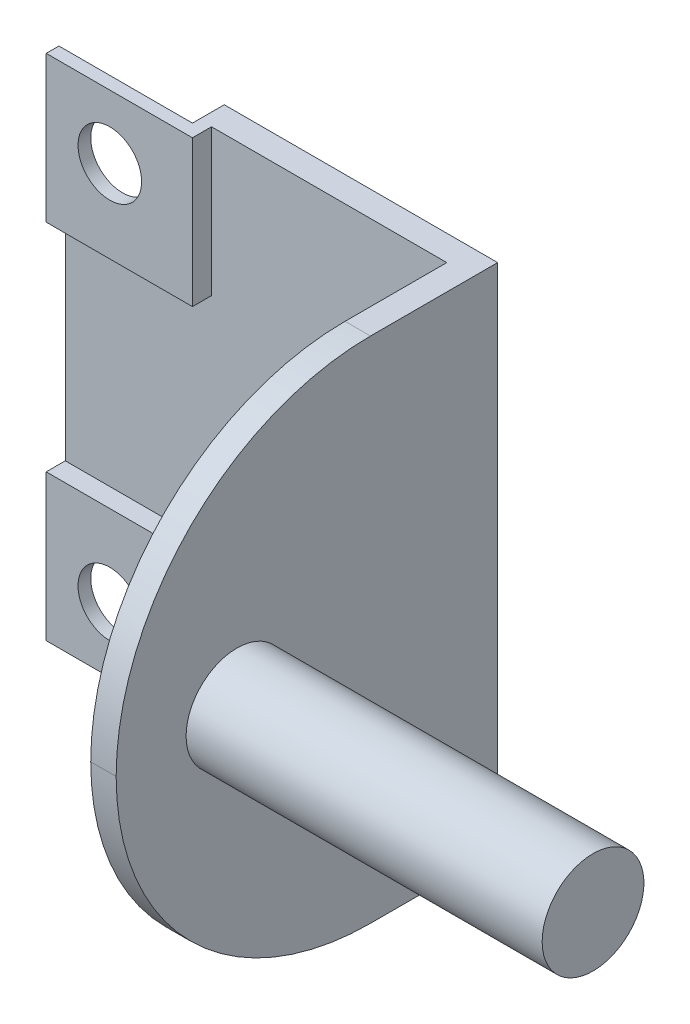
ISO-10303-21;
HEADER;
FILE_DESCRIPTION(('STEP AP214'),'2;1');
FILE_NAME('part.step','',(''),(''),'','','');
FILE_SCHEMA(('AUTOMOTIVE_DESIGN { 1 0 10303 214 1 1 1 1 }'));
ENDSEC;
DATA;
#1=APPLICATION_CONTEXT('core data for automotive mechanical design processes');
#2=APPLICATION_PROTOCOL_DEFINITION('international standard','automotive_design',2000,#1);
#3=PRODUCT_CONTEXT('',#1,'mechanical');
#4=PRODUCT('Part','Part','',(#3));
#5=PRODUCT_RELATED_PRODUCT_CATEGORY('part','',(#4));
#6=PRODUCT_DEFINITION_FORMATION('','',#4);
#7=PRODUCT_DEFINITION_CONTEXT('part definition',#1,'design');
#8=PRODUCT_DEFINITION('design','',#6,#7);
#9=PRODUCT_DEFINITION_SHAPE('','',#8);
#10=(LENGTH_UNIT() NAMED_UNIT(*) SI_UNIT(.MILLI.,.METRE.));
#11=(NAMED_UNIT(*) PLANE_ANGLE_UNIT() SI_UNIT($,.RADIAN.));
#12=(NAMED_UNIT(*) SI_UNIT($,.STERADIAN.) SOLID_ANGLE_UNIT());
#13=UNCERTAINTY_MEASURE_WITH_UNIT(LENGTH_MEASURE(1.E-05),#10,'distance_accuracy_value','');
#14=(GEOMETRIC_REPRESENTATION_CONTEXT(3) GLOBAL_UNCERTAINTY_ASSIGNED_CONTEXT((#13)) GLOBAL_UNIT_ASSIGNED_CONTEXT((#10,
#11,#12)) REPRESENTATION_CONTEXT('',''));
#15=CARTESIAN_POINT('',(0.,0.,0.));
#16=DIRECTION('',(0.,0.,1.));
#17=DIRECTION('',(1.,0.,0.));
#18=AXIS2_PLACEMENT_3D('',#15,#16,#17);
#19=CARTESIAN_POINT('',(-32.,10.5,-28.));
#20=DIRECTION('',(0.,1.,0.));
#21=DIRECTION('',(-1.,0.,0.));
#22=AXIS2_PLACEMENT_3D('',#19,#20,#21);
#23=PLANE('',#22);
#24=DIRECTION('',(1.,0.,0.));
#25=VECTOR('',#24,1.);
#26=CARTESIAN_POINT('',(-32.,10.5,2.5));
#27=LINE('',#26,#25);
#28=CARTESIAN_POINT('',(-32.,10.5,2.5));
#29=VERTEX_POINT('',#28);
#30=CARTESIAN_POINT('',(-21.5,10.5,2.5));
#31=VERTEX_POINT('',#30);
#32=EDGE_CURVE('E179',#29,#31,#27,.T.);
#33=ORIENTED_EDGE('',*,*,#32,.F.);
#34=DIRECTION('',(0.,0.,1.));
#35=VECTOR('',#34,1.);
#36=CARTESIAN_POINT('',(-32.,10.5,-28.));
#37=LINE('',#36,#35);
#38=CARTESIAN_POINT('',(-32.,10.5,0.));
#39=VERTEX_POINT('',#38);
#40=EDGE_CURVE('E191',#39,#29,#37,.T.);
#41=ORIENTED_EDGE('',*,*,#40,.F.);
#42=DIRECTION('',(-1.,0.,0.));
#43=VECTOR('',#42,1.);
#44=CARTESIAN_POINT('',(0.,10.5,0.));
#45=LINE('',#44,#43);
#46=CARTESIAN_POINT('',(-21.5,10.5,0.));
#47=VERTEX_POINT('',#46);
#48=EDGE_CURVE('E291',#47,#39,#45,.T.);
#49=ORIENTED_EDGE('',*,*,#48,.F.);
#50=DIRECTION('',(0.,0.,1.));
#51=VECTOR('',#50,1.);
#52=CARTESIAN_POINT('',(-21.5,10.5,-28.));
#53=LINE('',#52,#51);
#54=EDGE_CURVE('E67',#47,#31,#53,.T.);
#55=ORIENTED_EDGE('',*,*,#54,.T.);
#56=EDGE_LOOP('',(#33,#41,#49,#55));
#57=FACE_BOUND('',#56,.T.);
#58=ADVANCED_FACE('F41',(#57),#23,.F.);
#59=CARTESIAN_POINT('',(-21.5,0.,-28.));
#60=DIRECTION('',(1.,0.,0.));
#61=DIRECTION('',(0.,1.,0.));
#62=AXIS2_PLACEMENT_3D('',#59,#60,#61);
#63=PLANE('',#62);
#64=DIRECTION('',(0.,-1.,0.));
#65=VECTOR('',#64,1.);
#66=CARTESIAN_POINT('',(-21.5,0.,2.50000000000001));
#67=LINE('',#66,#65);
#68=CARTESIAN_POINT('',(-21.5,0.,2.50000000000001));
#69=VERTEX_POINT('',#68);
#70=EDGE_CURVE('E188',#31,#69,#67,.T.);
#71=ORIENTED_EDGE('',*,*,#70,.F.);
#72=ORIENTED_EDGE('',*,*,#54,.F.);
#73=DIRECTION('',(0.,1.,0.));
#74=VECTOR('',#73,1.);
#75=CARTESIAN_POINT('',(-21.5,0.,0.));
#76=LINE('',#75,#74);
#77=CARTESIAN_POINT('',(-21.5,0.,0.));
#78=VERTEX_POINT('',#77);
#79=EDGE_CURVE('E284',#78,#47,#76,.T.);
#80=ORIENTED_EDGE('',*,*,#79,.F.);
#81=DIRECTION('',(0.,0.,1.));
#82=VECTOR('',#81,1.);
#83=CARTESIAN_POINT('',(-21.5,0.,-28.));
#84=LINE('',#83,#82);
#85=EDGE_CURVE('E209',#78,#69,#84,.T.);
#86=ORIENTED_EDGE('',*,*,#85,.T.);
#87=EDGE_LOOP('',(#71,#72,#80,#86));
#88=FACE_BOUND('',#87,.T.);
#89=ADVANCED_FACE('F476',(#88),#63,.F.);
#90=CARTESIAN_POINT('',(-21.5,40.,-28.));
#91=DIRECTION('',(1.,0.,0.));
#92=DIRECTION('',(0.,0.,-1.));
#93=AXIS2_PLACEMENT_3D('',#90,#91,#92);
#94=PLANE('',#93);
#95=DIRECTION('',(0.,-1.,0.));
#96=VECTOR('',#95,1.);
#97=CARTESIAN_POINT('',(-21.5,40.,2.5));
#98=LINE('',#97,#96);
#99=CARTESIAN_POINT('',(-21.5,40.,2.5));
#100=VERTEX_POINT('',#99);
#101=CARTESIAN_POINT('',(-21.5,29.5,2.5));
#102=VERTEX_POINT('',#101);
#103=EDGE_CURVE('E194',#100,#102,#98,.T.);
#104=ORIENTED_EDGE('',*,*,#103,.F.);
#105=DIRECTION('',(0.,0.,1.));
#106=VECTOR('',#105,1.);
#107=CARTESIAN_POINT('',(-21.5,40.,-28.));
#108=LINE('',#107,#106);
#109=CARTESIAN_POINT('',(-21.5,40.,0.));
#110=VERTEX_POINT('',#109);
#111=EDGE_CURVE('E222',#110,#100,#108,.T.);
#112=ORIENTED_EDGE('',*,*,#111,.F.);
#113=DIRECTION('',(0.,1.,0.));
#114=VECTOR('',#113,1.);
#115=CARTESIAN_POINT('',(-21.5,0.,0.));
#116=LINE('',#115,#114);
#117=CARTESIAN_POINT('',(-21.5,29.5,0.));
#118=VERTEX_POINT('',#117);
#119=EDGE_CURVE('E11',#118,#110,#116,.T.);
#120=ORIENTED_EDGE('',*,*,#119,.F.);
#121=DIRECTION('',(0.,0.,1.));
#122=VECTOR('',#121,1.);
#123=CARTESIAN_POINT('',(-21.5,29.5,-28.));
#124=LINE('',#123,#122);
#125=EDGE_CURVE('E59',#118,#102,#124,.T.);
#126=ORIENTED_EDGE('',*,*,#125,.T.);
#127=EDGE_LOOP('',(#104,#112,#120,#126));
#128=FACE_BOUND('',#127,.T.);
#129=ADVANCED_FACE('F401',(#128),#94,.F.);
#130=CARTESIAN_POINT('',(-32.,29.5,-28.));
#131=DIRECTION('',(0.,-1.,0.));
#132=DIRECTION('',(0.,0.,-1.));
#133=AXIS2_PLACEMENT_3D('',#130,#131,#132);
#134=PLANE('',#133);
#135=DIRECTION('',(1.,0.,0.));
#136=VECTOR('',#135,1.);
#137=CARTESIAN_POINT('',(-32.,29.5,2.5));
#138=LINE('',#137,#136);
#139=CARTESIAN_POINT('',(-32.,29.5,2.5));
#140=VERTEX_POINT('',#139);
#141=EDGE_CURVE('E328',#140,#102,#138,.T.);
#142=ORIENTED_EDGE('',*,*,#141,.T.);
#143=ORIENTED_EDGE('',*,*,#125,.F.);
#144=DIRECTION('',(1.,0.,0.));
#145=VECTOR('',#144,1.);
#146=CARTESIAN_POINT('',(0.,29.5,0.));
#147=LINE('',#146,#145);
#148=CARTESIAN_POINT('',(-32.,29.5,0.));
#149=VERTEX_POINT('',#148);
#150=EDGE_CURVE('E51',#149,#118,#147,.T.);
#151=ORIENTED_EDGE('',*,*,#150,.F.);
#152=DIRECTION('',(0.,0.,1.));
#153=VECTOR('',#152,1.);
#154=CARTESIAN_POINT('',(-32.,29.5,-28.));
#155=LINE('',#154,#153);
#156=EDGE_CURVE('E203',#149,#140,#155,.T.);
#157=ORIENTED_EDGE('',*,*,#156,.T.);
#158=EDGE_LOOP('',(#142,#143,#151,#157));
#159=FACE_BOUND('',#158,.T.);
#160=ADVANCED_FACE('F405',(#159),#134,.F.);
#161=CARTESIAN_POINT('',(0.,0.,2.));
#162=DIRECTION('',(-1.,0.,0.));
#163=DIRECTION('',(0.,-1.,0.));
#164=AXIS2_PLACEMENT_3D('',#161,#162,#163);
#165=PLANE('',#164);
#166=CARTESIAN_POINT('',(0.,20.,20.5));
#167=DIRECTION('',(1.,0.,0.));
#168=DIRECTION('',(0.,1.,0.));
#169=AXIS2_PLACEMENT_3D('',#166,#167,#168);
#170=CIRCLE('',#169,4.);
#171=CARTESIAN_POINT('',(0.,24.,20.5));
#172=VERTEX_POINT('',#171);
#173=EDGE_CURVE('E217',#172,#172,#170,.T.);
#174=ORIENTED_EDGE('',*,*,#173,.F.);
#175=EDGE_LOOP('',(#174));
#176=FACE_BOUND('',#175,.T.);
#177=DIRECTION('',(0.,0.,-1.));
#178=VECTOR('',#177,1.);
#179=CARTESIAN_POINT('',(0.,40.,2.));
#180=LINE('',#179,#178);
#181=CARTESIAN_POINT('',(0.,40.,10.));
#182=VERTEX_POINT('',#181);
#183=CARTESIAN_POINT('',(0.,40.,0.));
#184=VERTEX_POINT('',#183);
#185=EDGE_CURVE('E262',#182,#184,#180,.T.);
#186=ORIENTED_EDGE('',*,*,#185,.F.);
#187=CARTESIAN_POINT('',(0.,20.,10.));
#188=DIRECTION('',(-1.,0.,0.));
#189=DIRECTION('',(0.,-1.,0.));
#190=AXIS2_PLACEMENT_3D('',#187,#188,#189);
#191=CIRCLE('',#190,20.);
#192=CARTESIAN_POINT('',(0.,20.,30.));
#193=VERTEX_POINT('',#192);
#194=EDGE_CURVE('E278',#182,#193,#191,.F.);
#195=ORIENTED_EDGE('',*,*,#194,.T.);
#196=CARTESIAN_POINT('',(0.,20.,10.));
#197=DIRECTION('',(-1.,0.,0.));
#198=DIRECTION('',(0.,-1.,0.));
#199=AXIS2_PLACEMENT_3D('',#196,#197,#198);
#200=CIRCLE('',#199,20.);
#201=CARTESIAN_POINT('',(0.,0.,10.));
#202=VERTEX_POINT('',#201);
#203=EDGE_CURVE('E275',#193,#202,#200,.F.);
#204=ORIENTED_EDGE('',*,*,#203,.T.);
#205=DIRECTION('',(0.,0.,-1.));
#206=VECTOR('',#205,1.);
#207=CARTESIAN_POINT('',(0.,0.,2.));
#208=LINE('',#207,#206);
#209=CARTESIAN_POINT('',(0.,0.,0.));
#210=VERTEX_POINT('',#209);
#211=EDGE_CURVE('E247',#202,#210,#208,.T.);
#212=ORIENTED_EDGE('',*,*,#211,.T.);
#213=DIRECTION('',(0.,1.,0.));
#214=VECTOR('',#213,1.);
#215=CARTESIAN_POINT('',(0.,0.,0.));
#216=LINE('',#215,#214);
#217=EDGE_CURVE('E234',#210,#184,#216,.T.);
#218=ORIENTED_EDGE('',*,*,#217,.T.);
#219=EDGE_LOOP('',(#186,#195,#204,#212,#218));
#220=FACE_BOUND('',#219,.T.);
#221=ADVANCED_FACE('F419',(#176,#220),#165,.F.);
#222=CARTESIAN_POINT('',(0.,40.,2.));
#223=DIRECTION('',(0.,-1.,0.));
#224=DIRECTION('',(1.,0.,0.));
#225=AXIS2_PLACEMENT_3D('',#222,#223,#224);
#226=PLANE('',#225);
#227=DIRECTION('',(-1.,0.,0.));
#228=VECTOR('',#227,1.);
#229=CARTESIAN_POINT('',(0.,40.,0.));
#230=LINE('',#229,#228);
#231=EDGE_CURVE('E251',#184,#110,#230,.T.);
#232=ORIENTED_EDGE('',*,*,#231,.T.);
#233=ORIENTED_EDGE('',*,*,#111,.T.);
#234=DIRECTION('',(1.,0.,0.));
#235=VECTOR('',#234,1.);
#236=CARTESIAN_POINT('',(-32.,40.,2.5));
#237=LINE('',#236,#235);
#238=CARTESIAN_POINT('',(-32.,40.,2.5));
#239=VERTEX_POINT('',#238);
#240=EDGE_CURVE('E333',#239,#100,#237,.T.);
#241=ORIENTED_EDGE('',*,*,#240,.F.);
#242=DIRECTION('',(0.,0.,-1.));
#243=VECTOR('',#242,1.);
#244=CARTESIAN_POINT('',(-32.,40.,3.5));
#245=LINE('',#244,#243);
#246=CARTESIAN_POINT('',(-32.,40.,3.5));
#247=VERTEX_POINT('',#246);
#248=EDGE_CURVE('E322',#247,#239,#245,.T.);
#249=ORIENTED_EDGE('',*,*,#248,.F.);
#250=DIRECTION('',(-1.,0.,0.));
#251=VECTOR('',#250,1.);
#252=CARTESIAN_POINT('',(0.,40.,3.5));
#253=LINE('',#252,#251);
#254=CARTESIAN_POINT('',(-20.5,40.,3.5));
#255=VERTEX_POINT('',#254);
#256=EDGE_CURVE('E371',#255,#247,#253,.T.);
#257=ORIENTED_EDGE('',*,*,#256,.F.);
#258=DIRECTION('',(0.,0.,-1.));
#259=VECTOR('',#258,1.);
#260=CARTESIAN_POINT('',(-20.5,40.,3.5));
#261=LINE('',#260,#259);
#262=CARTESIAN_POINT('',(-20.5,40.,2.));
#263=VERTEX_POINT('',#262);
#264=EDGE_CURVE('E216',#255,#263,#261,.T.);
#265=ORIENTED_EDGE('',*,*,#264,.T.);
#266=DIRECTION('',(-1.,0.,0.));
#267=VECTOR('',#266,1.);
#268=CARTESIAN_POINT('',(0.,40.,2.));
#269=LINE('',#268,#267);
#270=CARTESIAN_POINT('',(-2.,40.,2.));
#271=VERTEX_POINT('',#270);
#272=EDGE_CURVE('E235',#271,#263,#269,.T.);
#273=ORIENTED_EDGE('',*,*,#272,.F.);
#274=DIRECTION('',(0.,0.,-1.));
#275=VECTOR('',#274,1.);
#276=CARTESIAN_POINT('',(-2.,40.,30.));
#277=LINE('',#276,#275);
#278=CARTESIAN_POINT('',(-2.,40.,10.));
#279=VERTEX_POINT('',#278);
#280=EDGE_CURVE('E231',#279,#271,#277,.T.);
#281=ORIENTED_EDGE('',*,*,#280,.F.);
#282=DIRECTION('',(-1.,0.,0.));
#283=VECTOR('',#282,1.);
#284=CARTESIAN_POINT('',(0.,40.,10.));
#285=LINE('',#284,#283);
#286=EDGE_CURVE('E271',#279,#182,#285,.F.);
#287=ORIENTED_EDGE('',*,*,#286,.T.);
#288=ORIENTED_EDGE('',*,*,#185,.T.);
#289=EDGE_LOOP('',(#232,#233,#241,#249,#257,#265,#273,#281,#287,#288));
#290=FACE_BOUND('',#289,.T.);
#291=ADVANCED_FACE('F413',(#290),#226,.F.);
#292=CARTESIAN_POINT('',(-32.,0.,2.));
#293=DIRECTION('',(1.,0.,0.));
#294=DIRECTION('',(0.,0.,-1.));
#295=AXIS2_PLACEMENT_3D('',#292,#293,#294);
#296=PLANE('',#295);
#297=DIRECTION('',(0.,-1.,0.));
#298=VECTOR('',#297,1.);
#299=CARTESIAN_POINT('',(-32.,0.,2.));
#300=LINE('',#299,#298);
#301=CARTESIAN_POINT('',(-32.,28.5,2.));
#302=VERTEX_POINT('',#301);
#303=CARTESIAN_POINT('',(-32.,11.5,2.));
#304=VERTEX_POINT('',#303);
#305=EDGE_CURVE('E239',#302,#304,#300,.T.);
#306=ORIENTED_EDGE('',*,*,#305,.F.);
#307=DIRECTION('',(0.,0.,-1.));
#308=VECTOR('',#307,1.);
#309=CARTESIAN_POINT('',(-32.,28.5,3.5));
#310=LINE('',#309,#308);
#311=CARTESIAN_POINT('',(-32.,28.5,3.5));
#312=VERTEX_POINT('',#311);
#313=EDGE_CURVE('E391',#312,#302,#310,.T.);
#314=ORIENTED_EDGE('',*,*,#313,.F.);
#315=DIRECTION('',(0.,-1.,0.));
#316=VECTOR('',#315,1.);
#317=CARTESIAN_POINT('',(-32.,0.,3.5));
#318=LINE('',#317,#316);
#319=EDGE_CURVE('E376',#247,#312,#318,.T.);
#320=ORIENTED_EDGE('',*,*,#319,.F.);
#321=ORIENTED_EDGE('',*,*,#248,.T.);
#322=DIRECTION('',(0.,-1.,0.));
#323=VECTOR('',#322,1.);
#324=CARTESIAN_POINT('',(-32.,40.,2.5));
#325=LINE('',#324,#323);
#326=EDGE_CURVE('E325',#239,#140,#325,.T.);
#327=ORIENTED_EDGE('',*,*,#326,.T.);
#328=ORIENTED_EDGE('',*,*,#156,.F.);
#329=DIRECTION('',(0.,-1.,0.));
#330=VECTOR('',#329,1.);
#331=CARTESIAN_POINT('',(-32.,0.,0.));
#332=LINE('',#331,#330);
#333=EDGE_CURVE('E201',#149,#39,#332,.T.);
#334=ORIENTED_EDGE('',*,*,#333,.T.);
#335=ORIENTED_EDGE('',*,*,#40,.T.);
#336=DIRECTION('',(0.,-1.,0.));
#337=VECTOR('',#336,1.);
#338=CARTESIAN_POINT('',(-32.,0.,2.50000000000001));
#339=LINE('',#338,#337);
#340=CARTESIAN_POINT('',(-32.,0.,2.50000000000001));
#341=VERTEX_POINT('',#340);
#342=EDGE_CURVE('E176',#29,#341,#339,.T.);
#343=ORIENTED_EDGE('',*,*,#342,.T.);
#344=DIRECTION('',(0.,0.,1.));
#345=VECTOR('',#344,1.);
#346=CARTESIAN_POINT('',(-32.,0.,3.50000000000001));
#347=LINE('',#346,#345);
#348=CARTESIAN_POINT('',(-32.,0.,3.50000000000001));
#349=VERTEX_POINT('',#348);
#350=EDGE_CURVE('E187',#341,#349,#347,.T.);
#351=ORIENTED_EDGE('',*,*,#350,.T.);
#352=DIRECTION('',(0.,-1.,0.));
#353=VECTOR('',#352,1.);
#354=CARTESIAN_POINT('',(-32.,0.,3.5));
#355=LINE('',#354,#353);
#356=CARTESIAN_POINT('',(-32.,11.5,3.5));
#357=VERTEX_POINT('',#356);
#358=EDGE_CURVE('E341',#357,#349,#355,.T.);
#359=ORIENTED_EDGE('',*,*,#358,.F.);
#360=DIRECTION('',(0.,0.,-1.));
#361=VECTOR('',#360,1.);
#362=CARTESIAN_POINT('',(-32.,11.5,3.5));
#363=LINE('',#362,#361);
#364=EDGE_CURVE('E363',#357,#304,#363,.T.);
#365=ORIENTED_EDGE('',*,*,#364,.T.);
#366=EDGE_LOOP('',(#306,#314,#320,#321,#327,#328,#334,#335,#343,#351,#359,#365));
#367=FACE_BOUND('',#366,.T.);
#368=ADVANCED_FACE('F198',(#367),#296,.F.);
#369=CARTESIAN_POINT('',(0.,0.,2.));
#370=DIRECTION('',(0.,1.,0.));
#371=DIRECTION('',(-1.,0.,0.));
#372=AXIS2_PLACEMENT_3D('',#369,#370,#371);
#373=PLANE('',#372);
#374=DIRECTION('',(1.,0.,0.));
#375=VECTOR('',#374,1.);
#376=CARTESIAN_POINT('',(0.,0.,2.));
#377=LINE('',#376,#375);
#378=CARTESIAN_POINT('',(-20.5,0.,2.));
#379=VERTEX_POINT('',#378);
#380=CARTESIAN_POINT('',(-2.,0.,2.));
#381=VERTEX_POINT('',#380);
#382=EDGE_CURVE('E244',#379,#381,#377,.T.);
#383=ORIENTED_EDGE('',*,*,#382,.F.);
#384=DIRECTION('',(0.,0.,-1.));
#385=VECTOR('',#384,1.);
#386=CARTESIAN_POINT('',(-20.5,0.,3.5));
#387=LINE('',#386,#385);
#388=CARTESIAN_POINT('',(-20.5,0.,3.5));
#389=VERTEX_POINT('',#388);
#390=EDGE_CURVE('E360',#389,#379,#387,.T.);
#391=ORIENTED_EDGE('',*,*,#390,.F.);
#392=DIRECTION('',(1.,0.,0.));
#393=VECTOR('',#392,1.);
#394=CARTESIAN_POINT('',(0.,0.,3.5));
#395=LINE('',#394,#393);
#396=EDGE_CURVE('E345',#349,#389,#395,.T.);
#397=ORIENTED_EDGE('',*,*,#396,.F.);
#398=ORIENTED_EDGE('',*,*,#350,.F.);
#399=DIRECTION('',(1.,0.,0.));
#400=VECTOR('',#399,1.);
#401=CARTESIAN_POINT('',(-32.,0.,2.50000000000001));
#402=LINE('',#401,#400);
#403=EDGE_CURVE('E181',#341,#69,#402,.T.);
#404=ORIENTED_EDGE('',*,*,#403,.T.);
#405=ORIENTED_EDGE('',*,*,#85,.F.);
#406=DIRECTION('',(1.,0.,0.));
#407=VECTOR('',#406,1.);
#408=CARTESIAN_POINT('',(0.,0.,0.));
#409=LINE('',#408,#407);
#410=EDGE_CURVE('E240',#78,#210,#409,.T.);
#411=ORIENTED_EDGE('',*,*,#410,.T.);
#412=ORIENTED_EDGE('',*,*,#211,.F.);
#413=DIRECTION('',(1.,0.,0.));
#414=VECTOR('',#413,1.);
#415=CARTESIAN_POINT('',(-2.,0.,10.));
#416=LINE('',#415,#414);
#417=CARTESIAN_POINT('',(-2.,0.,10.));
#418=VERTEX_POINT('',#417);
#419=EDGE_CURVE('E281',#202,#418,#416,.F.);
#420=ORIENTED_EDGE('',*,*,#419,.T.);
#421=DIRECTION('',(0.,0.,-1.));
#422=VECTOR('',#421,1.);
#423=CARTESIAN_POINT('',(-2.,0.,30.));
#424=LINE('',#423,#422);
#425=EDGE_CURVE('E227',#418,#381,#424,.T.);
#426=ORIENTED_EDGE('',*,*,#425,.T.);
#427=EDGE_LOOP('',(#383,#391,#397,#398,#404,#405,#411,#412,#420,#426));
#428=FACE_BOUND('',#427,.T.);
#429=ADVANCED_FACE('F425',(#428),#373,.F.);
#430=CARTESIAN_POINT('',(0.,0.,2.));
#431=DIRECTION('',(0.,0.,1.));
#432=DIRECTION('',(1.,0.,0.));
#433=AXIS2_PLACEMENT_3D('',#430,#431,#432);
#434=PLANE('',#433);
#435=DIRECTION('',(1.,0.,0.));
#436=VECTOR('',#435,1.);
#437=CARTESIAN_POINT('',(0.,11.5,2.));
#438=LINE('',#437,#436);
#439=CARTESIAN_POINT('',(-20.5,11.5,2.));
#440=VERTEX_POINT('',#439);
#441=EDGE_CURVE('E336',#304,#440,#438,.T.);
#442=ORIENTED_EDGE('',*,*,#441,.T.);
#443=DIRECTION('',(0.,1.,0.));
#444=VECTOR('',#443,1.);
#445=CARTESIAN_POINT('',(-20.5,0.,2.));
#446=LINE('',#445,#444);
#447=EDGE_CURVE('E342',#379,#440,#446,.T.);
#448=ORIENTED_EDGE('',*,*,#447,.F.);
#449=ORIENTED_EDGE('',*,*,#382,.T.);
#450=DIRECTION('',(0.,-1.,0.));
#451=VECTOR('',#450,1.);
#452=CARTESIAN_POINT('',(-2.,0.,2.));
#453=LINE('',#452,#451);
#454=EDGE_CURVE('E223',#271,#381,#453,.T.);
#455=ORIENTED_EDGE('',*,*,#454,.F.);
#456=ORIENTED_EDGE('',*,*,#272,.T.);
#457=DIRECTION('',(0.,-1.,0.));
#458=VECTOR('',#457,1.);
#459=CARTESIAN_POINT('',(-20.5,0.,2.));
#460=LINE('',#459,#458);
#461=CARTESIAN_POINT('',(-20.5,28.5,2.));
#462=VERTEX_POINT('',#461);
#463=EDGE_CURVE('E366',#263,#462,#460,.T.);
#464=ORIENTED_EDGE('',*,*,#463,.T.);
#465=DIRECTION('',(1.,0.,0.));
#466=VECTOR('',#465,1.);
#467=CARTESIAN_POINT('',(0.,28.5,2.));
#468=LINE('',#467,#466);
#469=EDGE_CURVE('E372',#302,#462,#468,.T.);
#470=ORIENTED_EDGE('',*,*,#469,.F.);
#471=ORIENTED_EDGE('',*,*,#305,.T.);
#472=EDGE_LOOP('',(#442,#448,#449,#455,#456,#464,#470,#471));
#473=FACE_BOUND('',#472,.T.);
#474=ADVANCED_FACE('F441',(#473),#434,.T.);
#475=CARTESIAN_POINT('',(0.,0.,0.));
#476=DIRECTION('',(0.,0.,1.));
#477=DIRECTION('',(1.,0.,0.));
#478=AXIS2_PLACEMENT_3D('',#475,#476,#477);
#479=PLANE('',#478);
#480=ORIENTED_EDGE('',*,*,#150,.T.);
#481=ORIENTED_EDGE('',*,*,#119,.T.);
#482=ORIENTED_EDGE('',*,*,#231,.F.);
#483=ORIENTED_EDGE('',*,*,#217,.F.);
#484=ORIENTED_EDGE('',*,*,#410,.F.);
#485=ORIENTED_EDGE('',*,*,#79,.T.);
#486=ORIENTED_EDGE('',*,*,#48,.T.);
#487=ORIENTED_EDGE('',*,*,#333,.F.);
#488=EDGE_LOOP('',(#480,#481,#482,#483,#484,#485,#486,#487));
#489=FACE_BOUND('',#488,.T.);
#490=ADVANCED_FACE('F404',(#489),#479,.F.);
#491=CARTESIAN_POINT('',(-2.,0.,30.));
#492=DIRECTION('',(1.,0.,0.));
#493=DIRECTION('',(0.,0.,-1.));
#494=AXIS2_PLACEMENT_3D('',#491,#492,#493);
#495=PLANE('',#494);
#496=CARTESIAN_POINT('',(-2.,20.,10.));
#497=DIRECTION('',(1.,0.,0.));
#498=DIRECTION('',(0.,0.,-1.));
#499=AXIS2_PLACEMENT_3D('',#496,#497,#498);
#500=CIRCLE('',#499,20.);
#501=CARTESIAN_POINT('',(-2.,20.,30.));
#502=VERTEX_POINT('',#501);
#503=EDGE_CURVE('E265',#418,#502,#500,.F.);
#504=ORIENTED_EDGE('',*,*,#503,.T.);
#505=CARTESIAN_POINT('',(-2.,20.,10.));
#506=DIRECTION('',(1.,0.,0.));
#507=DIRECTION('',(0.,0.,-1.));
#508=AXIS2_PLACEMENT_3D('',#505,#506,#507);
#509=CIRCLE('',#508,20.);
#510=EDGE_CURVE('E268',#502,#279,#509,.F.);
#511=ORIENTED_EDGE('',*,*,#510,.T.);
#512=ORIENTED_EDGE('',*,*,#280,.T.);
#513=ORIENTED_EDGE('',*,*,#454,.T.);
#514=ORIENTED_EDGE('',*,*,#425,.F.);
#515=EDGE_LOOP('',(#504,#511,#512,#513,#514));
#516=FACE_BOUND('',#515,.T.);
#517=ADVANCED_FACE('F433',(#516),#495,.F.);
#518=CARTESIAN_POINT('',(0.,20.,10.));
#519=DIRECTION('',(-1.,0.,0.));
#520=DIRECTION('',(0.,-1.,0.));
#521=AXIS2_PLACEMENT_3D('',#518,#519,#520);
#522=CYLINDRICAL_SURFACE('',#521,20.);
#523=ORIENTED_EDGE('',*,*,#419,.F.);
#524=ORIENTED_EDGE('',*,*,#203,.F.);
#525=DIRECTION('',(1.,0.,0.));
#526=VECTOR('',#525,1.);
#527=CARTESIAN_POINT('',(0.,20.,30.));
#528=LINE('',#527,#526);
#529=EDGE_CURVE('E221',#502,#193,#528,.T.);
#530=ORIENTED_EDGE('',*,*,#529,.F.);
#531=ORIENTED_EDGE('',*,*,#503,.F.);
#532=EDGE_LOOP('',(#523,#524,#530,#531));
#533=FACE_BOUND('',#532,.T.);
#534=ADVANCED_FACE('F43',(#533),#522,.T.);
#535=CARTESIAN_POINT('',(0.,20.,10.));
#536=DIRECTION('',(1.,0.,0.));
#537=DIRECTION('',(0.,1.,0.));
#538=AXIS2_PLACEMENT_3D('',#535,#536,#537);
#539=CYLINDRICAL_SURFACE('',#538,20.);
#540=ORIENTED_EDGE('',*,*,#194,.F.);
#541=ORIENTED_EDGE('',*,*,#286,.F.);
#542=ORIENTED_EDGE('',*,*,#510,.F.);
#543=ORIENTED_EDGE('',*,*,#529,.T.);
#544=EDGE_LOOP('',(#540,#541,#542,#543));
#545=FACE_BOUND('',#544,.T.);
#546=ADVANCED_FACE('F466',(#545),#539,.T.);
#547=CARTESIAN_POINT('',(-20.5,0.,3.5));
#548=DIRECTION('',(1.,0.,0.));
#549=DIRECTION('',(0.,0.,-1.));
#550=AXIS2_PLACEMENT_3D('',#547,#548,#549);
#551=PLANE('',#550);
#552=ORIENTED_EDGE('',*,*,#463,.F.);
#553=ORIENTED_EDGE('',*,*,#264,.F.);
#554=DIRECTION('',(0.,-1.,0.));
#555=VECTOR('',#554,1.);
#556=CARTESIAN_POINT('',(-20.5,0.,3.5));
#557=LINE('',#556,#555);
#558=CARTESIAN_POINT('',(-20.5,28.5,3.5));
#559=VERTEX_POINT('',#558);
#560=EDGE_CURVE('E367',#255,#559,#557,.T.);
#561=ORIENTED_EDGE('',*,*,#560,.T.);
#562=DIRECTION('',(0.,0.,-1.));
#563=VECTOR('',#562,1.);
#564=CARTESIAN_POINT('',(-20.5,28.5,3.5));
#565=LINE('',#564,#563);
#566=EDGE_CURVE('E382',#559,#462,#565,.T.);
#567=ORIENTED_EDGE('',*,*,#566,.T.);
#568=EDGE_LOOP('',(#552,#553,#561,#567));
#569=FACE_BOUND('',#568,.T.);
#570=ADVANCED_FACE('F464',(#569),#551,.T.);
#571=CARTESIAN_POINT('',(0.,28.5,3.5));
#572=DIRECTION('',(0.,1.,0.));
#573=DIRECTION('',(0.,0.,1.));
#574=AXIS2_PLACEMENT_3D('',#571,#572,#573);
#575=PLANE('',#574);
#576=ORIENTED_EDGE('',*,*,#469,.T.);
#577=ORIENTED_EDGE('',*,*,#566,.F.);
#578=DIRECTION('',(1.,0.,0.));
#579=VECTOR('',#578,1.);
#580=CARTESIAN_POINT('',(0.,28.5,3.5));
#581=LINE('',#580,#579);
#582=EDGE_CURVE('E379',#312,#559,#581,.T.);
#583=ORIENTED_EDGE('',*,*,#582,.F.);
#584=ORIENTED_EDGE('',*,*,#313,.T.);
#585=EDGE_LOOP('',(#576,#577,#583,#584));
#586=FACE_BOUND('',#585,.T.);
#587=ADVANCED_FACE('F458',(#586),#575,.F.);
#588=CARTESIAN_POINT('',(0.,0.,3.5));
#589=DIRECTION('',(0.,0.,1.));
#590=DIRECTION('',(1.,0.,0.));
#591=AXIS2_PLACEMENT_3D('',#588,#589,#590);
#592=PLANE('',#591);
#593=CARTESIAN_POINT('',(-27.,35.,3.5));
#594=DIRECTION('',(0.,0.,1.));
#595=DIRECTION('',(1.,0.,0.));
#596=AXIS2_PLACEMENT_3D('',#593,#594,#595);
#597=CIRCLE('',#596,2.5);
#598=CARTESIAN_POINT('',(-24.5,35.,3.5));
#599=VERTEX_POINT('',#598);
#600=EDGE_CURVE('E299',#599,#599,#597,.T.);
#601=ORIENTED_EDGE('',*,*,#600,.F.);
#602=EDGE_LOOP('',(#601));
#603=FACE_BOUND('',#602,.T.);
#604=ORIENTED_EDGE('',*,*,#256,.T.);
#605=ORIENTED_EDGE('',*,*,#319,.T.);
#606=ORIENTED_EDGE('',*,*,#582,.T.);
#607=ORIENTED_EDGE('',*,*,#560,.F.);
#608=EDGE_LOOP('',(#604,#605,#606,#607));
#609=FACE_BOUND('',#608,.T.);
#610=ADVANCED_FACE('F462',(#603,#609),#592,.T.);
#611=CARTESIAN_POINT('',(0.,11.5,3.5));
#612=DIRECTION('',(0.,1.,0.));
#613=DIRECTION('',(0.,0.,1.));
#614=AXIS2_PLACEMENT_3D('',#611,#612,#613);
#615=PLANE('',#614);
#616=ORIENTED_EDGE('',*,*,#441,.F.);
#617=ORIENTED_EDGE('',*,*,#364,.F.);
#618=DIRECTION('',(1.,0.,0.));
#619=VECTOR('',#618,1.);
#620=CARTESIAN_POINT('',(0.,11.5,3.5));
#621=LINE('',#620,#619);
#622=CARTESIAN_POINT('',(-20.5,11.5,3.5));
#623=VERTEX_POINT('',#622);
#624=EDGE_CURVE('E337',#357,#623,#621,.T.);
#625=ORIENTED_EDGE('',*,*,#624,.T.);
#626=DIRECTION('',(0.,0.,-1.));
#627=VECTOR('',#626,1.);
#628=CARTESIAN_POINT('',(-20.5,11.5,3.5));
#629=LINE('',#628,#627);
#630=EDGE_CURVE('E351',#623,#440,#629,.T.);
#631=ORIENTED_EDGE('',*,*,#630,.T.);
#632=EDGE_LOOP('',(#616,#617,#625,#631));
#633=FACE_BOUND('',#632,.T.);
#634=ADVANCED_FACE('F453',(#633),#615,.T.);
#635=CARTESIAN_POINT('',(-20.5,0.,3.5));
#636=DIRECTION('',(-1.,0.,0.));
#637=DIRECTION('',(0.,-1.,0.));
#638=AXIS2_PLACEMENT_3D('',#635,#636,#637);
#639=PLANE('',#638);
#640=ORIENTED_EDGE('',*,*,#447,.T.);
#641=ORIENTED_EDGE('',*,*,#630,.F.);
#642=DIRECTION('',(0.,1.,0.));
#643=VECTOR('',#642,1.);
#644=CARTESIAN_POINT('',(-20.5,0.,3.5));
#645=LINE('',#644,#643);
#646=EDGE_CURVE('E348',#389,#623,#645,.T.);
#647=ORIENTED_EDGE('',*,*,#646,.F.);
#648=ORIENTED_EDGE('',*,*,#390,.T.);
#649=EDGE_LOOP('',(#640,#641,#647,#648));
#650=FACE_BOUND('',#649,.T.);
#651=ADVANCED_FACE('F446',(#650),#639,.F.);
#652=CARTESIAN_POINT('',(0.,0.,3.5));
#653=DIRECTION('',(0.,0.,1.));
#654=DIRECTION('',(1.,0.,0.));
#655=AXIS2_PLACEMENT_3D('',#652,#653,#654);
#656=PLANE('',#655);
#657=CARTESIAN_POINT('',(-27.,4.99999999999999,3.5));
#658=DIRECTION('',(0.,0.,1.));
#659=DIRECTION('',(-1.,0.,0.));
#660=AXIS2_PLACEMENT_3D('',#657,#658,#659);
#661=CIRCLE('',#660,2.5);
#662=CARTESIAN_POINT('',(-24.5,4.99999999999999,3.5));
#663=VERTEX_POINT('',#662);
#664=EDGE_CURVE('E306',#663,#663,#661,.T.);
#665=ORIENTED_EDGE('',*,*,#664,.F.);
#666=EDGE_LOOP('',(#665));
#667=FACE_BOUND('',#666,.T.);
#668=ORIENTED_EDGE('',*,*,#624,.F.);
#669=ORIENTED_EDGE('',*,*,#358,.T.);
#670=ORIENTED_EDGE('',*,*,#396,.T.);
#671=ORIENTED_EDGE('',*,*,#646,.T.);
#672=EDGE_LOOP('',(#668,#669,#670,#671));
#673=FACE_BOUND('',#672,.T.);
#674=ADVANCED_FACE('F449',(#667,#673),#656,.T.);
#675=CARTESIAN_POINT('',(-32.,40.,2.5));
#676=DIRECTION('',(0.,0.,1.));
#677=DIRECTION('',(0.,-1.,0.));
#678=AXIS2_PLACEMENT_3D('',#675,#676,#677);
#679=PLANE('',#678);
#680=CARTESIAN_POINT('',(-27.,35.,2.5));
#681=DIRECTION('',(0.,0.,1.));
#682=DIRECTION('',(0.,-1.,0.));
#683=AXIS2_PLACEMENT_3D('',#680,#681,#682);
#684=CIRCLE('',#683,2.5);
#685=CARTESIAN_POINT('',(-24.5,35.,2.5));
#686=VERTEX_POINT('',#685);
#687=EDGE_CURVE('E45',#686,#686,#684,.T.);
#688=ORIENTED_EDGE('',*,*,#687,.T.);
#689=EDGE_LOOP('',(#688));
#690=FACE_BOUND('',#689,.T.);
#691=ORIENTED_EDGE('',*,*,#103,.T.);
#692=ORIENTED_EDGE('',*,*,#141,.F.);
#693=ORIENTED_EDGE('',*,*,#326,.F.);
#694=ORIENTED_EDGE('',*,*,#240,.T.);
#695=EDGE_LOOP('',(#691,#692,#693,#694));
#696=FACE_BOUND('',#695,.T.);
#697=ADVANCED_FACE('F411',(#690,#696),#679,.F.);
#698=CARTESIAN_POINT('',(-32.,0.,2.50000000000001));
#699=DIRECTION('',(0.,0.,1.));
#700=DIRECTION('',(0.,-1.,0.));
#701=AXIS2_PLACEMENT_3D('',#698,#699,#700);
#702=PLANE('',#701);
#703=CARTESIAN_POINT('',(-27.,4.99999999999999,2.5));
#704=DIRECTION('',(0.,0.,1.));
#705=DIRECTION('',(0.,-1.,0.));
#706=AXIS2_PLACEMENT_3D('',#703,#704,#705);
#707=CIRCLE('',#706,2.5);
#708=CARTESIAN_POINT('',(-24.5,4.99999999999999,2.5));
#709=VERTEX_POINT('',#708);
#710=EDGE_CURVE('E296',#709,#709,#707,.T.);
#711=ORIENTED_EDGE('',*,*,#710,.T.);
#712=EDGE_LOOP('',(#711));
#713=FACE_BOUND('',#712,.T.);
#714=ORIENTED_EDGE('',*,*,#70,.T.);
#715=ORIENTED_EDGE('',*,*,#403,.F.);
#716=ORIENTED_EDGE('',*,*,#342,.F.);
#717=ORIENTED_EDGE('',*,*,#32,.T.);
#718=EDGE_LOOP('',(#714,#715,#716,#717));
#719=FACE_BOUND('',#718,.T.);
#720=ADVANCED_FACE('F178',(#713,#719),#702,.F.);
#721=CARTESIAN_POINT('',(-27.,4.99999999999999,-7.));
#722=DIRECTION('',(0.,0.,1.));
#723=DIRECTION('',(1.,0.,0.));
#724=AXIS2_PLACEMENT_3D('',#721,#722,#723);
#725=CYLINDRICAL_SURFACE('',#724,2.5);
#726=CARTESIAN_POINT('',(-24.5,4.99999999999999,3.5));
#727=CARTESIAN_POINT('',(-24.5,4.99999999999999,3.48958333333333));
#728=CARTESIAN_POINT('',(-24.5,4.99999999999999,3.47916666666667));
#729=CARTESIAN_POINT('',(-24.5,4.99999999999999,3.45833333333333));
#730=CARTESIAN_POINT('',(-24.5,4.99999999999999,3.44791666666667));
#731=CARTESIAN_POINT('',(-24.5,4.99999999999999,3.42708333333333));
#732=CARTESIAN_POINT('',(-24.5,4.99999999999999,3.41666666666667));
#733=CARTESIAN_POINT('',(-24.5,4.99999999999999,3.39583333333333));
#734=CARTESIAN_POINT('',(-24.5,4.99999999999999,3.38541666666667));
#735=CARTESIAN_POINT('',(-24.5,4.99999999999999,3.36458333333333));
#736=CARTESIAN_POINT('',(-24.5,4.99999999999999,3.35416666666667));
#737=CARTESIAN_POINT('',(-24.5,4.99999999999999,3.33333333333333));
#738=CARTESIAN_POINT('',(-24.5,4.99999999999999,3.32291666666667));
#739=CARTESIAN_POINT('',(-24.5,4.99999999999999,3.30208333333333));
#740=CARTESIAN_POINT('',(-24.5,4.99999999999999,3.29166666666667));
#741=CARTESIAN_POINT('',(-24.5,4.99999999999999,3.27083333333333));
#742=CARTESIAN_POINT('',(-24.5,4.99999999999999,3.26041666666667));
#743=CARTESIAN_POINT('',(-24.5,4.99999999999999,3.23958333333333));
#744=CARTESIAN_POINT('',(-24.5,4.99999999999999,3.22916666666667));
#745=CARTESIAN_POINT('',(-24.5,4.99999999999999,3.20833333333333));
#746=CARTESIAN_POINT('',(-24.5,4.99999999999999,3.19791666666667));
#747=CARTESIAN_POINT('',(-24.5,4.99999999999999,3.17708333333333));
#748=CARTESIAN_POINT('',(-24.5,4.99999999999999,3.16666666666667));
#749=CARTESIAN_POINT('',(-24.5,4.99999999999999,3.14583333333333));
#750=CARTESIAN_POINT('',(-24.5,4.99999999999999,3.13541666666667));
#751=CARTESIAN_POINT('',(-24.5,4.99999999999999,3.11458333333333));
#752=CARTESIAN_POINT('',(-24.5,4.99999999999999,3.10416666666667));
#753=CARTESIAN_POINT('',(-24.5,4.99999999999999,3.08333333333333));
#754=CARTESIAN_POINT('',(-24.5,4.99999999999999,3.07291666666667));
#755=CARTESIAN_POINT('',(-24.5,4.99999999999999,3.05208333333333));
#756=CARTESIAN_POINT('',(-24.5,4.99999999999999,3.04166666666667));
#757=CARTESIAN_POINT('',(-24.5,4.99999999999999,3.02083333333333));
#758=CARTESIAN_POINT('',(-24.5,4.99999999999999,3.01041666666667));
#759=CARTESIAN_POINT('',(-24.5,4.99999999999999,2.98958333333333));
#760=CARTESIAN_POINT('',(-24.5,4.99999999999999,2.97916666666667));
#761=CARTESIAN_POINT('',(-24.5,4.99999999999999,2.95833333333333));
#762=CARTESIAN_POINT('',(-24.5,4.99999999999999,2.94791666666667));
#763=CARTESIAN_POINT('',(-24.5,4.99999999999999,2.92708333333333));
#764=CARTESIAN_POINT('',(-24.5,4.99999999999999,2.91666666666667));
#765=CARTESIAN_POINT('',(-24.5,4.99999999999999,2.89583333333333));
#766=CARTESIAN_POINT('',(-24.5,4.99999999999999,2.88541666666667));
#767=CARTESIAN_POINT('',(-24.5,4.99999999999999,2.86458333333333));
#768=CARTESIAN_POINT('',(-24.5,4.99999999999999,2.85416666666667));
#769=CARTESIAN_POINT('',(-24.5,4.99999999999999,2.83333333333333));
#770=CARTESIAN_POINT('',(-24.5,4.99999999999999,2.82291666666667));
#771=CARTESIAN_POINT('',(-24.5,4.99999999999999,2.80208333333333));
#772=CARTESIAN_POINT('',(-24.5,4.99999999999999,2.79166666666667));
#773=CARTESIAN_POINT('',(-24.5,4.99999999999999,2.77083333333333));
#774=CARTESIAN_POINT('',(-24.5,4.99999999999999,2.76041666666667));
#775=CARTESIAN_POINT('',(-24.5,4.99999999999999,2.73958333333334));
#776=CARTESIAN_POINT('',(-24.5,4.99999999999999,2.72916666666667));
#777=CARTESIAN_POINT('',(-24.5,4.99999999999999,2.70833333333334));
#778=CARTESIAN_POINT('',(-24.5,4.99999999999999,2.69791666666667));
#779=CARTESIAN_POINT('',(-24.5,4.99999999999999,2.67708333333334));
#780=CARTESIAN_POINT('',(-24.5,4.99999999999999,2.66666666666667));
#781=CARTESIAN_POINT('',(-24.5,4.99999999999999,2.64583333333334));
#782=CARTESIAN_POINT('',(-24.5,4.99999999999999,2.63541666666667));
#783=CARTESIAN_POINT('',(-24.5,4.99999999999999,2.61458333333334));
#784=CARTESIAN_POINT('',(-24.5,4.99999999999999,2.60416666666667));
#785=CARTESIAN_POINT('',(-24.5,4.99999999999999,2.58333333333334));
#786=CARTESIAN_POINT('',(-24.5,4.99999999999999,2.57291666666667));
#787=CARTESIAN_POINT('',(-24.5,4.99999999999999,2.55208333333334));
#788=CARTESIAN_POINT('',(-24.5,4.99999999999999,2.54166666666667));
#789=CARTESIAN_POINT('',(-24.5,4.99999999999999,2.52083333333334));
#790=CARTESIAN_POINT('',(-24.5,4.99999999999999,2.51041666666667));
#791=CARTESIAN_POINT('',(-24.5,4.99999999999999,2.5));
#792=B_SPLINE_CURVE_WITH_KNOTS('',3,(#726,#727,#728,#729,#730,#731,#732,#733,#734,#735,#736,
#737,#738,#739,#740,#741,#742,#743,#744,#745,#746,#747,#748,#749,#750,#751,#752,#753,#754,#755,
#756,#757,#758,#759,#760,#761,#762,#763,#764,#765,#766,#767,#768,#769,#770,#771,#772,#773,#774,
#775,#776,#777,#778,#779,#780,#781,#782,#783,#784,#785,#786,#787,#788,#789,#790,#791),
.UNSPECIFIED.,.F.,.F.,(4,2,2,2,2,2,2,2,2,2,2,2,2,2,2,2,2,2,2,2,2,2,2,2,2,2,2,2,2,2,2,2,4),(0.,
0.03125,0.0625000000000001,0.0937500000000001,0.125,0.15625,0.1875,0.21875,0.25,
0.281249999999999,0.312499999999999,0.343749999999999,0.374999999999999,0.406249999999999,
0.437499999999999,0.468749999999999,0.499999999999999,0.531249999999999,0.562499999999999,
0.593749999999999,0.624999999999999,0.656249999999999,0.687499999999999,0.718749999999999,
0.749999999999997,0.781249999999997,0.812499999999997,0.843749999999997,0.874999999999997,
0.906249999999997,0.937499999999997,0.968749999999997,0.999999999999997),.UNSPECIFIED.);
#793=EDGE_CURVE('BSEAM515',#663,#709,#792,.T.);
#794=ORIENTED_EDGE('',*,*,#664,.T.);
#795=ORIENTED_EDGE('',*,*,#710,.F.);
#796=ORIENTED_EDGE('',*,*,#793,.T.);
#797=ORIENTED_EDGE('',*,*,#793,.F.);
#798=EDGE_LOOP('',(#794,#796,#795,#797));
#799=FACE_BOUND('',#798,.T.);
#800=ADVANCED_FACE('F515',(#799),#725,.F.);
#801=CARTESIAN_POINT('',(-27.,35.,-7.));
#802=DIRECTION('',(0.,0.,1.));
#803=DIRECTION('',(1.,0.,0.));
#804=AXIS2_PLACEMENT_3D('',#801,#802,#803);
#805=CYLINDRICAL_SURFACE('',#804,2.5);
#806=CARTESIAN_POINT('',(-24.5,35.,3.5));
#807=CARTESIAN_POINT('',(-24.5,35.,3.48958333333333));
#808=CARTESIAN_POINT('',(-24.5,35.,3.47916666666667));
#809=CARTESIAN_POINT('',(-24.5,35.,3.45833333333333));
#810=CARTESIAN_POINT('',(-24.5,35.,3.44791666666667));
#811=CARTESIAN_POINT('',(-24.5,35.,3.42708333333333));
#812=CARTESIAN_POINT('',(-24.5,35.,3.41666666666667));
#813=CARTESIAN_POINT('',(-24.5,35.,3.39583333333333));
#814=CARTESIAN_POINT('',(-24.5,35.,3.38541666666667));
#815=CARTESIAN_POINT('',(-24.5,35.,3.36458333333333));
#816=CARTESIAN_POINT('',(-24.5,35.,3.35416666666667));
#817=CARTESIAN_POINT('',(-24.5,35.,3.33333333333333));
#818=CARTESIAN_POINT('',(-24.5,35.,3.32291666666667));
#819=CARTESIAN_POINT('',(-24.5,35.,3.30208333333333));
#820=CARTESIAN_POINT('',(-24.5,35.,3.29166666666667));
#821=CARTESIAN_POINT('',(-24.5,35.,3.27083333333333));
#822=CARTESIAN_POINT('',(-24.5,35.,3.26041666666667));
#823=CARTESIAN_POINT('',(-24.5,35.,3.23958333333333));
#824=CARTESIAN_POINT('',(-24.5,35.,3.22916666666667));
#825=CARTESIAN_POINT('',(-24.5,35.,3.20833333333333));
#826=CARTESIAN_POINT('',(-24.5,35.,3.19791666666667));
#827=CARTESIAN_POINT('',(-24.5,35.,3.17708333333333));
#828=CARTESIAN_POINT('',(-24.5,35.,3.16666666666667));
#829=CARTESIAN_POINT('',(-24.5,35.,3.14583333333333));
#830=CARTESIAN_POINT('',(-24.5,35.,3.13541666666667));
#831=CARTESIAN_POINT('',(-24.5,35.,3.11458333333333));
#832=CARTESIAN_POINT('',(-24.5,35.,3.10416666666667));
#833=CARTESIAN_POINT('',(-24.5,35.,3.08333333333333));
#834=CARTESIAN_POINT('',(-24.5,35.,3.07291666666667));
#835=CARTESIAN_POINT('',(-24.5,35.,3.05208333333333));
#836=CARTESIAN_POINT('',(-24.5,35.,3.04166666666667));
#837=CARTESIAN_POINT('',(-24.5,35.,3.02083333333333));
#838=CARTESIAN_POINT('',(-24.5,35.,3.01041666666667));
#839=CARTESIAN_POINT('',(-24.5,35.,2.98958333333333));
#840=CARTESIAN_POINT('',(-24.5,35.,2.97916666666667));
#841=CARTESIAN_POINT('',(-24.5,35.,2.95833333333333));
#842=CARTESIAN_POINT('',(-24.5,35.,2.94791666666667));
#843=CARTESIAN_POINT('',(-24.5,35.,2.92708333333333));
#844=CARTESIAN_POINT('',(-24.5,35.,2.91666666666667));
#845=CARTESIAN_POINT('',(-24.5,35.,2.89583333333333));
#846=CARTESIAN_POINT('',(-24.5,35.,2.88541666666667));
#847=CARTESIAN_POINT('',(-24.5,35.,2.86458333333333));
#848=CARTESIAN_POINT('',(-24.5,35.,2.85416666666667));
#849=CARTESIAN_POINT('',(-24.5,35.,2.83333333333333));
#850=CARTESIAN_POINT('',(-24.5,35.,2.82291666666667));
#851=CARTESIAN_POINT('',(-24.5,35.,2.80208333333333));
#852=CARTESIAN_POINT('',(-24.5,35.,2.79166666666667));
#853=CARTESIAN_POINT('',(-24.5,35.,2.77083333333333));
#854=CARTESIAN_POINT('',(-24.5,35.,2.76041666666667));
#855=CARTESIAN_POINT('',(-24.5,35.,2.73958333333333));
#856=CARTESIAN_POINT('',(-24.5,35.,2.72916666666667));
#857=CARTESIAN_POINT('',(-24.5,35.,2.70833333333333));
#858=CARTESIAN_POINT('',(-24.5,35.,2.69791666666667));
#859=CARTESIAN_POINT('',(-24.5,35.,2.67708333333333));
#860=CARTESIAN_POINT('',(-24.5,35.,2.66666666666667));
#861=CARTESIAN_POINT('',(-24.5,35.,2.64583333333333));
#862=CARTESIAN_POINT('',(-24.5,35.,2.63541666666667));
#863=CARTESIAN_POINT('',(-24.5,35.,2.61458333333333));
#864=CARTESIAN_POINT('',(-24.5,35.,2.60416666666667));
#865=CARTESIAN_POINT('',(-24.5,35.,2.58333333333333));
#866=CARTESIAN_POINT('',(-24.5,35.,2.57291666666667));
#867=CARTESIAN_POINT('',(-24.5,35.,2.55208333333333));
#868=CARTESIAN_POINT('',(-24.5,35.,2.54166666666667));
#869=CARTESIAN_POINT('',(-24.5,35.,2.52083333333333));
#870=CARTESIAN_POINT('',(-24.5,35.,2.51041666666667));
#871=CARTESIAN_POINT('',(-24.5,35.,2.5));
#872=B_SPLINE_CURVE_WITH_KNOTS('',3,(#806,#807,#808,#809,#810,#811,#812,#813,#814,#815,#816,
#817,#818,#819,#820,#821,#822,#823,#824,#825,#826,#827,#828,#829,#830,#831,#832,#833,#834,#835,
#836,#837,#838,#839,#840,#841,#842,#843,#844,#845,#846,#847,#848,#849,#850,#851,#852,#853,#854,
#855,#856,#857,#858,#859,#860,#861,#862,#863,#864,#865,#866,#867,#868,#869,#870,#871),
.UNSPECIFIED.,.F.,.F.,(4,2,2,2,2,2,2,2,2,2,2,2,2,2,2,2,2,2,2,2,2,2,2,2,2,2,2,2,2,2,2,2,4),(0.,
0.03125,0.0625000000000001,0.0937500000000001,0.125,0.15625,0.1875,0.21875,0.25,0.28125,0.3125,
0.34375,0.375,0.40625,0.4375,0.46875,0.5,0.53125,0.5625,0.593750000000001,0.625000000000001,
0.656250000000001,0.687500000000001,0.718750000000001,0.750000000000001,0.781250000000001,
0.812500000000001,0.843750000000001,0.875000000000001,0.906250000000001,0.937500000000001,
0.968750000000001,1.),.UNSPECIFIED.);
#873=EDGE_CURVE('BSEAM506',#599,#686,#872,.T.);
#874=ORIENTED_EDGE('',*,*,#600,.T.);
#875=ORIENTED_EDGE('',*,*,#687,.F.);
#876=ORIENTED_EDGE('',*,*,#873,.T.);
#877=ORIENTED_EDGE('',*,*,#873,.F.);
#878=EDGE_LOOP('',(#874,#876,#875,#877));
#879=FACE_BOUND('',#878,.T.);
#880=ADVANCED_FACE('F506',(#879),#805,.F.);
#881=CARTESIAN_POINT('',(28.,20.,20.5));
#882=DIRECTION('',(-1.,0.,0.));
#883=DIRECTION('',(0.,0.,1.));
#884=AXIS2_PLACEMENT_3D('',#881,#882,#883);
#885=CYLINDRICAL_SURFACE('',#884,4.);
#886=CARTESIAN_POINT('',(28.,20.,20.5));
#887=DIRECTION('',(-1.,0.,0.));
#888=DIRECTION('',(0.,0.,1.));
#889=AXIS2_PLACEMENT_3D('',#886,#887,#888);
#890=CIRCLE('',#889,4.);
#891=CARTESIAN_POINT('',(28.,20.,24.5));
#892=VERTEX_POINT('',#891);
#893=EDGE_CURVE('E312',#892,#892,#890,.T.);
#894=ORIENTED_EDGE('',*,*,#893,.T.);
#895=EDGE_LOOP('',(#894));
#896=FACE_BOUND('',#895,.T.);
#897=ORIENTED_EDGE('',*,*,#173,.T.);
#898=EDGE_LOOP('',(#897));
#899=FACE_BOUND('',#898,.T.);
#900=ADVANCED_FACE('F503',(#896,#899),#885,.T.);
#901=CARTESIAN_POINT('',(28.,20.,20.5));
#902=DIRECTION('',(-1.,0.,0.));
#903=DIRECTION('',(0.,0.,1.));
#904=AXIS2_PLACEMENT_3D('',#901,#902,#903);
#905=PLANE('',#904);
#906=ORIENTED_EDGE('',*,*,#893,.F.);
#907=EDGE_LOOP('',(#906));
#908=FACE_BOUND('',#907,.T.);
#909=ADVANCED_FACE('F505',(#908),#905,.F.);
#910=CLOSED_SHELL('',(#58,#89,#129,#160,#221,#291,#368,#429,#474,#490,#517,#534,#546,#570,#587,
#610,#634,#651,#674,#697,#720,#800,#880,#900,#909));
#911=MANIFOLD_SOLID_BREP('B2',#910);
#912=ADVANCED_BREP_SHAPE_REPRESENTATION('',(#18,#911),#14);
#913=SHAPE_DEFINITION_REPRESENTATION(#9,#912);
ENDSEC;
END-ISO-10303-21;
